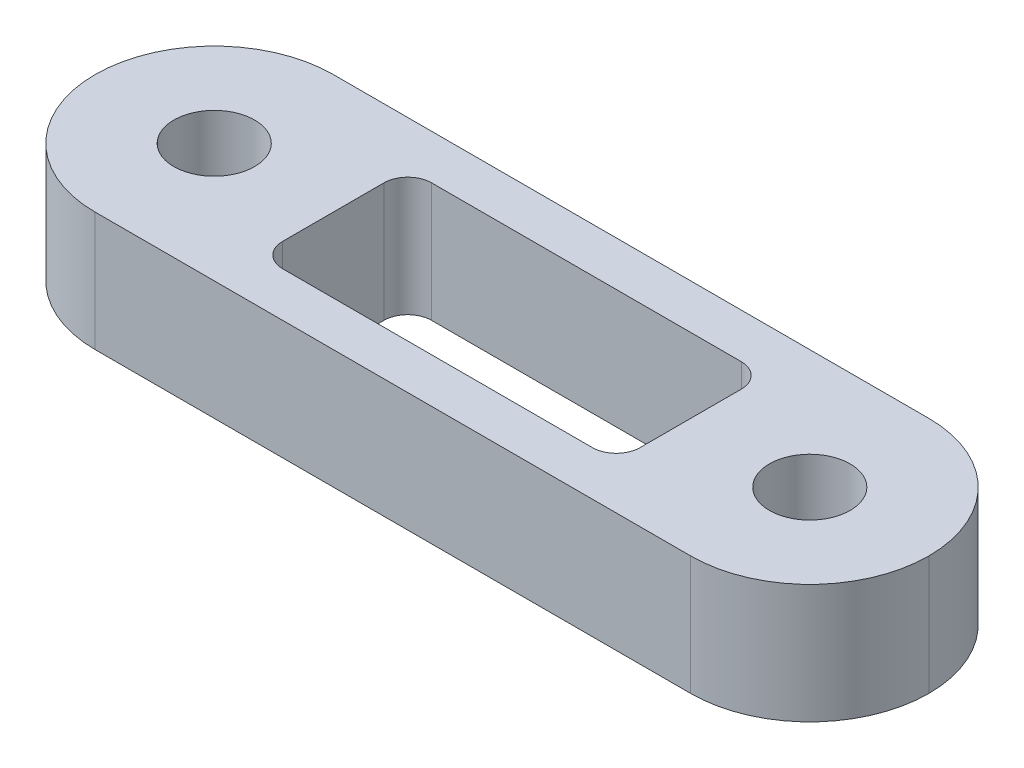
ISO-10303-21;
HEADER;
FILE_DESCRIPTION(('STEP AP214'),'2;1');
FILE_NAME('part.step','',(''),(''),'','','');
FILE_SCHEMA(('AUTOMOTIVE_DESIGN { 1 0 10303 214 1 1 1 1 }'));
ENDSEC;
DATA;
#1=APPLICATION_CONTEXT('core data for automotive mechanical design processes');
#2=APPLICATION_PROTOCOL_DEFINITION('international standard','automotive_design',2000,#1);
#3=PRODUCT_CONTEXT('',#1,'mechanical');
#4=PRODUCT('Part','Part','',(#3));
#5=PRODUCT_RELATED_PRODUCT_CATEGORY('part','',(#4));
#6=PRODUCT_DEFINITION_FORMATION('','',#4);
#7=PRODUCT_DEFINITION_CONTEXT('part definition',#1,'design');
#8=PRODUCT_DEFINITION('design','',#6,#7);
#9=PRODUCT_DEFINITION_SHAPE('','',#8);
#10=(LENGTH_UNIT() NAMED_UNIT(*) SI_UNIT(.MILLI.,.METRE.));
#11=(NAMED_UNIT(*) PLANE_ANGLE_UNIT() SI_UNIT($,.RADIAN.));
#12=(NAMED_UNIT(*) SI_UNIT($,.STERADIAN.) SOLID_ANGLE_UNIT());
#13=UNCERTAINTY_MEASURE_WITH_UNIT(LENGTH_MEASURE(1.E-05),#10,'distance_accuracy_value','');
#14=(GEOMETRIC_REPRESENTATION_CONTEXT(3) GLOBAL_UNCERTAINTY_ASSIGNED_CONTEXT((#13)) GLOBAL_UNIT_ASSIGNED_CONTEXT((#10,
#11,#12)) REPRESENTATION_CONTEXT('',''));
#15=CARTESIAN_POINT('',(0.,0.,0.));
#16=DIRECTION('',(0.,0.,1.));
#17=DIRECTION('',(1.,0.,0.));
#18=AXIS2_PLACEMENT_3D('',#15,#16,#17);
#19=CARTESIAN_POINT('',(-22.225,6.35,-6.35));
#20=DIRECTION('',(0.,0.,1.));
#21=DIRECTION('',(1.,0.,0.));
#22=AXIS2_PLACEMENT_3D('',#19,#20,#21);
#23=PLANE('',#22);
#24=DIRECTION('',(-1.,0.,0.));
#25=VECTOR('',#24,1.);
#26=CARTESIAN_POINT('',(-22.225,6.35,-6.35));
#27=LINE('',#26,#25);
#28=CARTESIAN_POINT('',(15.875,6.35,-6.35));
#29=VERTEX_POINT('',#28);
#30=CARTESIAN_POINT('',(-15.875,6.35,-6.35));
#31=VERTEX_POINT('',#30);
#32=EDGE_CURVE('E249',#29,#31,#27,.T.);
#33=ORIENTED_EDGE('',*,*,#32,.F.);
#34=DIRECTION('',(0.,-1.,0.));
#35=VECTOR('',#34,1.);
#36=CARTESIAN_POINT('',(15.875,6.35,-6.35));
#37=LINE('',#36,#35);
#38=CARTESIAN_POINT('',(15.875,0.,-6.35));
#39=VERTEX_POINT('',#38);
#40=EDGE_CURVE('E270',#29,#39,#37,.T.);
#41=ORIENTED_EDGE('',*,*,#40,.T.);
#42=DIRECTION('',(-1.,0.,0.));
#43=VECTOR('',#42,1.);
#44=CARTESIAN_POINT('',(-22.225,0.,-6.35));
#45=LINE('',#44,#43);
#46=CARTESIAN_POINT('',(-15.875,0.,-6.35));
#47=VERTEX_POINT('',#46);
#48=EDGE_CURVE('E259',#39,#47,#45,.T.);
#49=ORIENTED_EDGE('',*,*,#48,.T.);
#50=DIRECTION('',(0.,-1.,0.));
#51=VECTOR('',#50,1.);
#52=CARTESIAN_POINT('',(-15.875,6.35,-6.35));
#53=LINE('',#52,#51);
#54=EDGE_CURVE('E258',#47,#31,#53,.F.);
#55=ORIENTED_EDGE('',*,*,#54,.T.);
#56=EDGE_LOOP('',(#33,#41,#49,#55));
#57=FACE_BOUND('',#56,.T.);
#58=ADVANCED_FACE('F38',(#57),#23,.F.);
#59=CARTESIAN_POINT('',(-22.225,6.35,6.35));
#60=DIRECTION('',(0.,0.,-1.));
#61=DIRECTION('',(-1.,0.,0.));
#62=AXIS2_PLACEMENT_3D('',#59,#60,#61);
#63=PLANE('',#62);
#64=DIRECTION('',(1.,0.,0.));
#65=VECTOR('',#64,1.);
#66=CARTESIAN_POINT('',(-22.225,0.,6.35));
#67=LINE('',#66,#65);
#68=CARTESIAN_POINT('',(-15.875,0.,6.35));
#69=VERTEX_POINT('',#68);
#70=CARTESIAN_POINT('',(15.875,0.,6.35));
#71=VERTEX_POINT('',#70);
#72=EDGE_CURVE('E254',#69,#71,#67,.T.);
#73=ORIENTED_EDGE('',*,*,#72,.T.);
#74=DIRECTION('',(0.,-1.,0.));
#75=VECTOR('',#74,1.);
#76=CARTESIAN_POINT('',(15.875,6.35,6.35));
#77=LINE('',#76,#75);
#78=CARTESIAN_POINT('',(15.875,6.35,6.35));
#79=VERTEX_POINT('',#78);
#80=EDGE_CURVE('E11',#71,#79,#77,.F.);
#81=ORIENTED_EDGE('',*,*,#80,.T.);
#82=DIRECTION('',(1.,0.,0.));
#83=VECTOR('',#82,1.);
#84=CARTESIAN_POINT('',(-22.225,6.35,6.35));
#85=LINE('',#84,#83);
#86=CARTESIAN_POINT('',(-15.875,6.35,6.35));
#87=VERTEX_POINT('',#86);
#88=EDGE_CURVE('E253',#87,#79,#85,.T.);
#89=ORIENTED_EDGE('',*,*,#88,.F.);
#90=DIRECTION('',(0.,-1.,0.));
#91=VECTOR('',#90,1.);
#92=CARTESIAN_POINT('',(-15.875,6.35,6.35));
#93=LINE('',#92,#91);
#94=EDGE_CURVE('E48',#87,#69,#93,.T.);
#95=ORIENTED_EDGE('',*,*,#94,.T.);
#96=EDGE_LOOP('',(#73,#81,#89,#95));
#97=FACE_BOUND('',#96,.T.);
#98=ADVANCED_FACE('F320',(#97),#63,.F.);
#99=CARTESIAN_POINT('',(0.,6.35,0.));
#100=DIRECTION('',(0.,-1.,0.));
#101=DIRECTION('',(0.,0.,-1.));
#102=AXIS2_PLACEMENT_3D('',#99,#100,#101);
#103=PLANE('',#102);
#104=DIRECTION('',(1.,0.,0.));
#105=VECTOR('',#104,1.);
#106=CARTESIAN_POINT('',(-8.255,6.35,3.96875));
#107=LINE('',#106,#105);
#108=CARTESIAN_POINT('',(-8.255,6.35,3.96875));
#109=VERTEX_POINT('',#108);
#110=CARTESIAN_POINT('',(8.255,6.35,3.96875));
#111=VERTEX_POINT('',#110);
#112=EDGE_CURVE('E191',#109,#111,#107,.T.);
#113=ORIENTED_EDGE('',*,*,#112,.F.);
#114=CARTESIAN_POINT('',(-8.255,6.35,2.69875));
#115=DIRECTION('',(0.,1.,0.));
#116=DIRECTION('',(0.,0.,1.));
#117=AXIS2_PLACEMENT_3D('',#114,#115,#116);
#118=CIRCLE('',#117,1.27);
#119=CARTESIAN_POINT('',(-9.525,6.35,2.69875));
#120=VERTEX_POINT('',#119);
#121=EDGE_CURVE('E56',#120,#109,#118,.T.);
#122=ORIENTED_EDGE('',*,*,#121,.F.);
#123=DIRECTION('',(0.,0.,1.));
#124=VECTOR('',#123,1.);
#125=CARTESIAN_POINT('',(-9.525,6.35,-2.69875));
#126=LINE('',#125,#124);
#127=CARTESIAN_POINT('',(-9.525,6.35,-2.69875));
#128=VERTEX_POINT('',#127);
#129=EDGE_CURVE('E163',#128,#120,#126,.T.);
#130=ORIENTED_EDGE('',*,*,#129,.F.);
#131=CARTESIAN_POINT('',(-8.255,6.35,-2.69875));
#132=DIRECTION('',(0.,1.,0.));
#133=DIRECTION('',(0.,0.,1.));
#134=AXIS2_PLACEMENT_3D('',#131,#132,#133);
#135=CIRCLE('',#134,1.27);
#136=CARTESIAN_POINT('',(-8.255,6.35,-3.96875));
#137=VERTEX_POINT('',#136);
#138=EDGE_CURVE('E167',#137,#128,#135,.T.);
#139=ORIENTED_EDGE('',*,*,#138,.F.);
#140=DIRECTION('',(-1.,0.,0.));
#141=VECTOR('',#140,1.);
#142=CARTESIAN_POINT('',(-8.255,6.35,-3.96875));
#143=LINE('',#142,#141);
#144=CARTESIAN_POINT('',(8.255,6.35,-3.96875));
#145=VERTEX_POINT('',#144);
#146=EDGE_CURVE('E206',#145,#137,#143,.T.);
#147=ORIENTED_EDGE('',*,*,#146,.F.);
#148=CARTESIAN_POINT('',(8.255,6.35,-2.69875));
#149=DIRECTION('',(0.,1.,0.));
#150=DIRECTION('',(0.,0.,-1.));
#151=AXIS2_PLACEMENT_3D('',#148,#149,#150);
#152=CIRCLE('',#151,1.27);
#153=CARTESIAN_POINT('',(9.525,6.35,-2.69875));
#154=VERTEX_POINT('',#153);
#155=EDGE_CURVE('E202',#154,#145,#152,.T.);
#156=ORIENTED_EDGE('',*,*,#155,.F.);
#157=DIRECTION('',(0.,0.,-1.));
#158=VECTOR('',#157,1.);
#159=CARTESIAN_POINT('',(9.525,6.35,-2.69875));
#160=LINE('',#159,#158);
#161=CARTESIAN_POINT('',(9.525,6.35,2.69875));
#162=VERTEX_POINT('',#161);
#163=EDGE_CURVE('E198',#162,#154,#160,.T.);
#164=ORIENTED_EDGE('',*,*,#163,.F.);
#165=CARTESIAN_POINT('',(8.255,6.35,2.69875));
#166=DIRECTION('',(0.,1.,0.));
#167=DIRECTION('',(0.,0.,1.));
#168=AXIS2_PLACEMENT_3D('',#165,#166,#167);
#169=CIRCLE('',#168,1.27);
#170=EDGE_CURVE('E194',#111,#162,#169,.T.);
#171=ORIENTED_EDGE('',*,*,#170,.F.);
#172=EDGE_LOOP('',(#113,#122,#130,#139,#147,#156,#164,#171));
#173=FACE_BOUND('',#172,.T.);
#174=CARTESIAN_POINT('',(-15.875,6.35,0.));
#175=DIRECTION('',(0.,1.,0.));
#176=DIRECTION('',(0.,0.,1.));
#177=AXIS2_PLACEMENT_3D('',#174,#175,#176);
#178=CIRCLE('',#177,2.15264999999999);
#179=CARTESIAN_POINT('',(-15.875,6.35,2.15264999999999));
#180=VERTEX_POINT('',#179);
#181=EDGE_CURVE('E216',#180,#180,#178,.T.);
#182=ORIENTED_EDGE('',*,*,#181,.F.);
#183=EDGE_LOOP('',(#182));
#184=FACE_BOUND('',#183,.T.);
#185=CARTESIAN_POINT('',(15.875,6.35,0.));
#186=DIRECTION('',(0.,1.,0.));
#187=DIRECTION('',(0.,0.,1.));
#188=AXIS2_PLACEMENT_3D('',#185,#186,#187);
#189=CIRCLE('',#188,2.15264999999999);
#190=CARTESIAN_POINT('',(15.875,6.35,2.15264999999998));
#191=VERTEX_POINT('',#190);
#192=EDGE_CURVE('E241',#191,#191,#189,.T.);
#193=ORIENTED_EDGE('',*,*,#192,.F.);
#194=EDGE_LOOP('',(#193));
#195=FACE_BOUND('',#194,.T.);
#196=CARTESIAN_POINT('',(15.875,6.35,0.));
#197=DIRECTION('',(0.,-1.,0.));
#198=DIRECTION('',(0.,0.,-1.));
#199=AXIS2_PLACEMENT_3D('',#196,#197,#198);
#200=CIRCLE('',#199,6.35);
#201=CARTESIAN_POINT('',(22.225,6.35,0.));
#202=VERTEX_POINT('',#201);
#203=EDGE_CURVE('E292',#79,#202,#200,.F.);
#204=ORIENTED_EDGE('',*,*,#203,.T.);
#205=CARTESIAN_POINT('',(15.875,6.35,0.));
#206=DIRECTION('',(0.,-1.,0.));
#207=DIRECTION('',(0.,0.,-1.));
#208=AXIS2_PLACEMENT_3D('',#205,#206,#207);
#209=CIRCLE('',#208,6.35);
#210=EDGE_CURVE('E295',#202,#29,#209,.F.);
#211=ORIENTED_EDGE('',*,*,#210,.T.);
#212=ORIENTED_EDGE('',*,*,#32,.T.);
#213=CARTESIAN_POINT('',(-15.875,6.35,0.));
#214=DIRECTION('',(0.,-1.,0.));
#215=DIRECTION('',(0.,0.,-1.));
#216=AXIS2_PLACEMENT_3D('',#213,#214,#215);
#217=CIRCLE('',#216,6.35);
#218=CARTESIAN_POINT('',(-22.225,6.35,0.));
#219=VERTEX_POINT('',#218);
#220=EDGE_CURVE('E289',#31,#219,#217,.F.);
#221=ORIENTED_EDGE('',*,*,#220,.T.);
#222=CARTESIAN_POINT('',(-15.875,6.35,0.));
#223=DIRECTION('',(0.,-1.,0.));
#224=DIRECTION('',(0.,0.,-1.));
#225=AXIS2_PLACEMENT_3D('',#222,#223,#224);
#226=CIRCLE('',#225,6.35);
#227=EDGE_CURVE('E286',#219,#87,#226,.F.);
#228=ORIENTED_EDGE('',*,*,#227,.T.);
#229=ORIENTED_EDGE('',*,*,#88,.T.);
#230=EDGE_LOOP('',(#204,#211,#212,#221,#228,#229));
#231=FACE_BOUND('',#230,.T.);
#232=ADVANCED_FACE('F317',(#173,#184,#195,#231),#103,.F.);
#233=CARTESIAN_POINT('',(0.,0.,0.));
#234=DIRECTION('',(0.,-1.,0.));
#235=DIRECTION('',(0.,0.,-1.));
#236=AXIS2_PLACEMENT_3D('',#233,#234,#235);
#237=PLANE('',#236);
#238=CARTESIAN_POINT('',(-8.255,0.,2.69875));
#239=DIRECTION('',(0.,1.,0.));
#240=DIRECTION('',(0.,0.,1.));
#241=AXIS2_PLACEMENT_3D('',#238,#239,#240);
#242=CIRCLE('',#241,1.27);
#243=CARTESIAN_POINT('',(-9.525,0.,2.69875));
#244=VERTEX_POINT('',#243);
#245=CARTESIAN_POINT('',(-8.255,0.,3.96875));
#246=VERTEX_POINT('',#245);
#247=EDGE_CURVE('E143',#244,#246,#242,.T.);
#248=ORIENTED_EDGE('',*,*,#247,.T.);
#249=DIRECTION('',(1.,0.,0.));
#250=VECTOR('',#249,1.);
#251=CARTESIAN_POINT('',(-8.255,0.,3.96875));
#252=LINE('',#251,#250);
#253=CARTESIAN_POINT('',(8.255,0.,3.96875));
#254=VERTEX_POINT('',#253);
#255=EDGE_CURVE('E153',#246,#254,#252,.T.);
#256=ORIENTED_EDGE('',*,*,#255,.T.);
#257=CARTESIAN_POINT('',(8.255,0.,2.69875));
#258=DIRECTION('',(0.,1.,0.));
#259=DIRECTION('',(0.,0.,1.));
#260=AXIS2_PLACEMENT_3D('',#257,#258,#259);
#261=CIRCLE('',#260,1.27);
#262=CARTESIAN_POINT('',(9.525,0.,2.69875));
#263=VERTEX_POINT('',#262);
#264=EDGE_CURVE('E64',#254,#263,#261,.T.);
#265=ORIENTED_EDGE('',*,*,#264,.T.);
#266=DIRECTION('',(0.,0.,-1.));
#267=VECTOR('',#266,1.);
#268=CARTESIAN_POINT('',(9.525,0.,-2.69875));
#269=LINE('',#268,#267);
#270=CARTESIAN_POINT('',(9.525,0.,-2.69875));
#271=VERTEX_POINT('',#270);
#272=EDGE_CURVE('E172',#263,#271,#269,.T.);
#273=ORIENTED_EDGE('',*,*,#272,.T.);
#274=CARTESIAN_POINT('',(8.255,0.,-2.69875));
#275=DIRECTION('',(0.,1.,0.));
#276=DIRECTION('',(0.,0.,-1.));
#277=AXIS2_PLACEMENT_3D('',#274,#275,#276);
#278=CIRCLE('',#277,1.27);
#279=CARTESIAN_POINT('',(8.255,0.,-3.96875));
#280=VERTEX_POINT('',#279);
#281=EDGE_CURVE('E176',#271,#280,#278,.T.);
#282=ORIENTED_EDGE('',*,*,#281,.T.);
#283=DIRECTION('',(-1.,0.,0.));
#284=VECTOR('',#283,1.);
#285=CARTESIAN_POINT('',(-8.255,0.,-3.96875));
#286=LINE('',#285,#284);
#287=CARTESIAN_POINT('',(-8.255,0.,-3.96875));
#288=VERTEX_POINT('',#287);
#289=EDGE_CURVE('E180',#280,#288,#286,.T.);
#290=ORIENTED_EDGE('',*,*,#289,.T.);
#291=CARTESIAN_POINT('',(-8.255,0.,-2.69875));
#292=DIRECTION('',(0.,1.,0.));
#293=DIRECTION('',(0.,0.,1.));
#294=AXIS2_PLACEMENT_3D('',#291,#292,#293);
#295=CIRCLE('',#294,1.27);
#296=CARTESIAN_POINT('',(-9.525,0.,-2.69875));
#297=VERTEX_POINT('',#296);
#298=EDGE_CURVE('E184',#288,#297,#295,.T.);
#299=ORIENTED_EDGE('',*,*,#298,.T.);
#300=DIRECTION('',(0.,0.,1.));
#301=VECTOR('',#300,1.);
#302=CARTESIAN_POINT('',(-9.525,0.,-2.69875));
#303=LINE('',#302,#301);
#304=EDGE_CURVE('E150',#297,#244,#303,.T.);
#305=ORIENTED_EDGE('',*,*,#304,.T.);
#306=EDGE_LOOP('',(#248,#256,#265,#273,#282,#290,#299,#305));
#307=FACE_BOUND('',#306,.T.);
#308=CARTESIAN_POINT('',(-15.875,0.,0.));
#309=DIRECTION('',(0.,1.,0.));
#310=DIRECTION('',(0.,0.,1.));
#311=AXIS2_PLACEMENT_3D('',#308,#309,#310);
#312=CIRCLE('',#311,2.15264999999999);
#313=CARTESIAN_POINT('',(-15.875,0.,2.15264999999999));
#314=VERTEX_POINT('',#313);
#315=EDGE_CURVE('E237',#314,#314,#312,.T.);
#316=ORIENTED_EDGE('',*,*,#315,.T.);
#317=EDGE_LOOP('',(#316));
#318=FACE_BOUND('',#317,.T.);
#319=CARTESIAN_POINT('',(15.875,0.,0.));
#320=DIRECTION('',(0.,1.,0.));
#321=DIRECTION('',(0.,0.,1.));
#322=AXIS2_PLACEMENT_3D('',#319,#320,#321);
#323=CIRCLE('',#322,2.15264999999999);
#324=CARTESIAN_POINT('',(15.875,0.,2.15264999999998));
#325=VERTEX_POINT('',#324);
#326=EDGE_CURVE('E245',#325,#325,#323,.T.);
#327=ORIENTED_EDGE('',*,*,#326,.T.);
#328=EDGE_LOOP('',(#327));
#329=FACE_BOUND('',#328,.T.);
#330=ORIENTED_EDGE('',*,*,#48,.F.);
#331=CARTESIAN_POINT('',(15.875,0.,0.));
#332=DIRECTION('',(0.,-1.,0.));
#333=DIRECTION('',(0.,0.,-1.));
#334=AXIS2_PLACEMENT_3D('',#331,#332,#333);
#335=CIRCLE('',#334,6.35);
#336=CARTESIAN_POINT('',(22.225,0.,0.));
#337=VERTEX_POINT('',#336);
#338=EDGE_CURVE('E283',#39,#337,#335,.T.);
#339=ORIENTED_EDGE('',*,*,#338,.T.);
#340=CARTESIAN_POINT('',(15.875,0.,0.));
#341=DIRECTION('',(0.,-1.,0.));
#342=DIRECTION('',(0.,0.,-1.));
#343=AXIS2_PLACEMENT_3D('',#340,#341,#342);
#344=CIRCLE('',#343,6.35);
#345=EDGE_CURVE('E280',#337,#71,#344,.T.);
#346=ORIENTED_EDGE('',*,*,#345,.T.);
#347=ORIENTED_EDGE('',*,*,#72,.F.);
#348=CARTESIAN_POINT('',(-15.875,0.,0.));
#349=DIRECTION('',(0.,-1.,0.));
#350=DIRECTION('',(0.,0.,-1.));
#351=AXIS2_PLACEMENT_3D('',#348,#349,#350);
#352=CIRCLE('',#351,6.35);
#353=CARTESIAN_POINT('',(-22.225,0.,0.));
#354=VERTEX_POINT('',#353);
#355=EDGE_CURVE('E274',#69,#354,#352,.T.);
#356=ORIENTED_EDGE('',*,*,#355,.T.);
#357=CARTESIAN_POINT('',(-15.875,0.,0.));
#358=DIRECTION('',(0.,-1.,0.));
#359=DIRECTION('',(0.,0.,-1.));
#360=AXIS2_PLACEMENT_3D('',#357,#358,#359);
#361=CIRCLE('',#360,6.35);
#362=EDGE_CURVE('E277',#354,#47,#361,.T.);
#363=ORIENTED_EDGE('',*,*,#362,.T.);
#364=EDGE_LOOP('',(#330,#339,#346,#347,#356,#363));
#365=FACE_BOUND('',#364,.T.);
#366=ADVANCED_FACE('F158',(#307,#318,#329,#365),#237,.T.);
#367=CARTESIAN_POINT('',(15.875,6.35,0.));
#368=DIRECTION('',(0.,-1.,0.));
#369=DIRECTION('',(0.,0.,-1.));
#370=AXIS2_PLACEMENT_3D('',#367,#368,#369);
#371=CYLINDRICAL_SURFACE('',#370,6.35);
#372=DIRECTION('',(0.,-1.,0.));
#373=VECTOR('',#372,1.);
#374=CARTESIAN_POINT('',(22.225,6.35,0.));
#375=LINE('',#374,#373);
#376=EDGE_CURVE('E263',#202,#337,#375,.T.);
#377=ORIENTED_EDGE('',*,*,#376,.F.);
#378=ORIENTED_EDGE('',*,*,#203,.F.);
#379=ORIENTED_EDGE('',*,*,#80,.F.);
#380=ORIENTED_EDGE('',*,*,#345,.F.);
#381=EDGE_LOOP('',(#377,#378,#379,#380));
#382=FACE_BOUND('',#381,.T.);
#383=ADVANCED_FACE('F325',(#382),#371,.T.);
#384=CARTESIAN_POINT('',(15.875,6.35,0.));
#385=DIRECTION('',(0.,-1.,0.));
#386=DIRECTION('',(0.,0.,-1.));
#387=AXIS2_PLACEMENT_3D('',#384,#385,#386);
#388=CYLINDRICAL_SURFACE('',#387,6.35);
#389=ORIENTED_EDGE('',*,*,#210,.F.);
#390=ORIENTED_EDGE('',*,*,#376,.T.);
#391=ORIENTED_EDGE('',*,*,#338,.F.);
#392=ORIENTED_EDGE('',*,*,#40,.F.);
#393=EDGE_LOOP('',(#389,#390,#391,#392));
#394=FACE_BOUND('',#393,.T.);
#395=ADVANCED_FACE('F330',(#394),#388,.T.);
#396=CARTESIAN_POINT('',(-15.875,6.35,0.));
#397=DIRECTION('',(0.,-1.,0.));
#398=DIRECTION('',(0.,0.,-1.));
#399=AXIS2_PLACEMENT_3D('',#396,#397,#398);
#400=CYLINDRICAL_SURFACE('',#399,6.35);
#401=ORIENTED_EDGE('',*,*,#94,.F.);
#402=ORIENTED_EDGE('',*,*,#227,.F.);
#403=DIRECTION('',(0.,-1.,0.));
#404=VECTOR('',#403,1.);
#405=CARTESIAN_POINT('',(-22.225,6.35,0.));
#406=LINE('',#405,#404);
#407=EDGE_CURVE('E42',#354,#219,#406,.F.);
#408=ORIENTED_EDGE('',*,*,#407,.F.);
#409=ORIENTED_EDGE('',*,*,#355,.F.);
#410=EDGE_LOOP('',(#401,#402,#408,#409));
#411=FACE_BOUND('',#410,.T.);
#412=ADVANCED_FACE('F40',(#411),#400,.T.);
#413=CARTESIAN_POINT('',(-15.875,6.35,0.));
#414=DIRECTION('',(0.,-1.,0.));
#415=DIRECTION('',(0.,0.,-1.));
#416=AXIS2_PLACEMENT_3D('',#413,#414,#415);
#417=CYLINDRICAL_SURFACE('',#416,6.35);
#418=ORIENTED_EDGE('',*,*,#220,.F.);
#419=ORIENTED_EDGE('',*,*,#54,.F.);
#420=ORIENTED_EDGE('',*,*,#362,.F.);
#421=ORIENTED_EDGE('',*,*,#407,.T.);
#422=EDGE_LOOP('',(#418,#419,#420,#421));
#423=FACE_BOUND('',#422,.T.);
#424=ADVANCED_FACE('F309',(#423),#417,.T.);
#425=CARTESIAN_POINT('',(15.875,6.35,0.));
#426=DIRECTION('',(0.,1.,0.));
#427=DIRECTION('',(0.,0.,1.));
#428=AXIS2_PLACEMENT_3D('',#425,#426,#427);
#429=CYLINDRICAL_SURFACE('',#428,2.15264999999999);
#430=ORIENTED_EDGE('',*,*,#326,.F.);
#431=EDGE_LOOP('',(#430));
#432=FACE_BOUND('',#431,.T.);
#433=ORIENTED_EDGE('',*,*,#192,.T.);
#434=EDGE_LOOP('',(#433));
#435=FACE_BOUND('',#434,.T.);
#436=ADVANCED_FACE('F350',(#432,#435),#429,.F.);
#437=CARTESIAN_POINT('',(-15.875,6.35,0.));
#438=DIRECTION('',(0.,1.,0.));
#439=DIRECTION('',(0.,0.,1.));
#440=AXIS2_PLACEMENT_3D('',#437,#438,#439);
#441=CYLINDRICAL_SURFACE('',#440,2.15264999999999);
#442=ORIENTED_EDGE('',*,*,#315,.F.);
#443=EDGE_LOOP('',(#442));
#444=FACE_BOUND('',#443,.T.);
#445=ORIENTED_EDGE('',*,*,#181,.T.);
#446=EDGE_LOOP('',(#445));
#447=FACE_BOUND('',#446,.T.);
#448=ADVANCED_FACE('F355',(#444,#447),#441,.F.);
#449=CARTESIAN_POINT('',(-8.255,0.,2.69875));
#450=DIRECTION('',(0.,1.,0.));
#451=DIRECTION('',(0.,0.,1.));
#452=AXIS2_PLACEMENT_3D('',#449,#450,#451);
#453=CYLINDRICAL_SURFACE('',#452,1.27);
#454=ORIENTED_EDGE('',*,*,#121,.T.);
#455=DIRECTION('',(0.,1.,0.));
#456=VECTOR('',#455,1.);
#457=CARTESIAN_POINT('',(-8.255,0.,3.96875));
#458=LINE('',#457,#456);
#459=EDGE_CURVE('E139',#246,#109,#458,.T.);
#460=ORIENTED_EDGE('',*,*,#459,.F.);
#461=ORIENTED_EDGE('',*,*,#247,.F.);
#462=DIRECTION('',(0.,1.,0.));
#463=VECTOR('',#462,1.);
#464=CARTESIAN_POINT('',(-9.525,0.,2.69875));
#465=LINE('',#464,#463);
#466=EDGE_CURVE('E213',#244,#120,#465,.T.);
#467=ORIENTED_EDGE('',*,*,#466,.T.);
#468=EDGE_LOOP('',(#454,#460,#461,#467));
#469=FACE_BOUND('',#468,.T.);
#470=ADVANCED_FACE('F141',(#469),#453,.F.);
#471=CARTESIAN_POINT('',(-9.525,0.,-2.69875));
#472=DIRECTION('',(-1.,0.,0.));
#473=DIRECTION('',(0.,0.,1.));
#474=AXIS2_PLACEMENT_3D('',#471,#472,#473);
#475=PLANE('',#474);
#476=ORIENTED_EDGE('',*,*,#129,.T.);
#477=ORIENTED_EDGE('',*,*,#466,.F.);
#478=ORIENTED_EDGE('',*,*,#304,.F.);
#479=DIRECTION('',(0.,1.,0.));
#480=VECTOR('',#479,1.);
#481=CARTESIAN_POINT('',(-9.525,0.,-2.69875));
#482=LINE('',#481,#480);
#483=EDGE_CURVE('E217',#297,#128,#482,.T.);
#484=ORIENTED_EDGE('',*,*,#483,.T.);
#485=EDGE_LOOP('',(#476,#477,#478,#484));
#486=FACE_BOUND('',#485,.T.);
#487=ADVANCED_FACE('F402',(#486),#475,.F.);
#488=CARTESIAN_POINT('',(-8.255,0.,-2.69875));
#489=DIRECTION('',(0.,1.,0.));
#490=DIRECTION('',(0.,0.,1.));
#491=AXIS2_PLACEMENT_3D('',#488,#489,#490);
#492=CYLINDRICAL_SURFACE('',#491,1.27);
#493=ORIENTED_EDGE('',*,*,#138,.T.);
#494=ORIENTED_EDGE('',*,*,#483,.F.);
#495=ORIENTED_EDGE('',*,*,#298,.F.);
#496=DIRECTION('',(0.,1.,0.));
#497=VECTOR('',#496,1.);
#498=CARTESIAN_POINT('',(-8.255,0.,-3.96875));
#499=LINE('',#498,#497);
#500=EDGE_CURVE('E220',#288,#137,#499,.T.);
#501=ORIENTED_EDGE('',*,*,#500,.T.);
#502=EDGE_LOOP('',(#493,#494,#495,#501));
#503=FACE_BOUND('',#502,.T.);
#504=ADVANCED_FACE('F411',(#503),#492,.F.);
#505=CARTESIAN_POINT('',(-8.255,0.,-3.96875));
#506=DIRECTION('',(0.,0.,-1.));
#507=DIRECTION('',(-1.,0.,0.));
#508=AXIS2_PLACEMENT_3D('',#505,#506,#507);
#509=PLANE('',#508);
#510=ORIENTED_EDGE('',*,*,#146,.T.);
#511=ORIENTED_EDGE('',*,*,#500,.F.);
#512=ORIENTED_EDGE('',*,*,#289,.F.);
#513=DIRECTION('',(0.,1.,0.));
#514=VECTOR('',#513,1.);
#515=CARTESIAN_POINT('',(8.255,0.,-3.96875));
#516=LINE('',#515,#514);
#517=EDGE_CURVE('E223',#280,#145,#516,.T.);
#518=ORIENTED_EDGE('',*,*,#517,.T.);
#519=EDGE_LOOP('',(#510,#511,#512,#518));
#520=FACE_BOUND('',#519,.T.);
#521=ADVANCED_FACE('F421',(#520),#509,.F.);
#522=CARTESIAN_POINT('',(8.255,0.,-2.69875));
#523=DIRECTION('',(0.,1.,0.));
#524=DIRECTION('',(0.,0.,1.));
#525=AXIS2_PLACEMENT_3D('',#522,#523,#524);
#526=CYLINDRICAL_SURFACE('',#525,1.27);
#527=ORIENTED_EDGE('',*,*,#155,.T.);
#528=ORIENTED_EDGE('',*,*,#517,.F.);
#529=ORIENTED_EDGE('',*,*,#281,.F.);
#530=DIRECTION('',(0.,1.,0.));
#531=VECTOR('',#530,1.);
#532=CARTESIAN_POINT('',(9.525,0.,-2.69875));
#533=LINE('',#532,#531);
#534=EDGE_CURVE('E226',#271,#154,#533,.T.);
#535=ORIENTED_EDGE('',*,*,#534,.T.);
#536=EDGE_LOOP('',(#527,#528,#529,#535));
#537=FACE_BOUND('',#536,.T.);
#538=ADVANCED_FACE('F431',(#537),#526,.F.);
#539=CARTESIAN_POINT('',(9.525,0.,-2.69875));
#540=DIRECTION('',(1.,0.,0.));
#541=DIRECTION('',(0.,0.,-1.));
#542=AXIS2_PLACEMENT_3D('',#539,#540,#541);
#543=PLANE('',#542);
#544=ORIENTED_EDGE('',*,*,#163,.T.);
#545=ORIENTED_EDGE('',*,*,#534,.F.);
#546=ORIENTED_EDGE('',*,*,#272,.F.);
#547=DIRECTION('',(0.,1.,0.));
#548=VECTOR('',#547,1.);
#549=CARTESIAN_POINT('',(9.525,0.,2.69875));
#550=LINE('',#549,#548);
#551=EDGE_CURVE('E229',#263,#162,#550,.T.);
#552=ORIENTED_EDGE('',*,*,#551,.T.);
#553=EDGE_LOOP('',(#544,#545,#546,#552));
#554=FACE_BOUND('',#553,.T.);
#555=ADVANCED_FACE('F441',(#554),#543,.F.);
#556=CARTESIAN_POINT('',(8.255,0.,2.69875));
#557=DIRECTION('',(0.,1.,0.));
#558=DIRECTION('',(0.,0.,1.));
#559=AXIS2_PLACEMENT_3D('',#556,#557,#558);
#560=CYLINDRICAL_SURFACE('',#559,1.27);
#561=ORIENTED_EDGE('',*,*,#170,.T.);
#562=ORIENTED_EDGE('',*,*,#551,.F.);
#563=ORIENTED_EDGE('',*,*,#264,.F.);
#564=DIRECTION('',(0.,1.,0.));
#565=VECTOR('',#564,1.);
#566=CARTESIAN_POINT('',(8.255,0.,3.96875));
#567=LINE('',#566,#565);
#568=EDGE_CURVE('E149',#254,#111,#567,.T.);
#569=ORIENTED_EDGE('',*,*,#568,.T.);
#570=EDGE_LOOP('',(#561,#562,#563,#569));
#571=FACE_BOUND('',#570,.T.);
#572=ADVANCED_FACE('F451',(#571),#560,.F.);
#573=CARTESIAN_POINT('',(-8.255,0.,3.96875));
#574=DIRECTION('',(0.,0.,1.));
#575=DIRECTION('',(1.,0.,0.));
#576=AXIS2_PLACEMENT_3D('',#573,#574,#575);
#577=PLANE('',#576);
#578=ORIENTED_EDGE('',*,*,#112,.T.);
#579=ORIENTED_EDGE('',*,*,#568,.F.);
#580=ORIENTED_EDGE('',*,*,#255,.F.);
#581=ORIENTED_EDGE('',*,*,#459,.T.);
#582=EDGE_LOOP('',(#578,#579,#580,#581));
#583=FACE_BOUND('',#582,.T.);
#584=ADVANCED_FACE('F154',(#583),#577,.F.);
#585=CLOSED_SHELL('',(#58,#98,#232,#366,#383,#395,#412,#424,#436,#448,#470,#487,#504,#521,#538,
#555,#572,#584));
#586=MANIFOLD_SOLID_BREP('B2',#585);
#587=ADVANCED_BREP_SHAPE_REPRESENTATION('',(#18,#586),#14);
#588=SHAPE_DEFINITION_REPRESENTATION(#9,#587);
ENDSEC;
END-ISO-10303-21;
